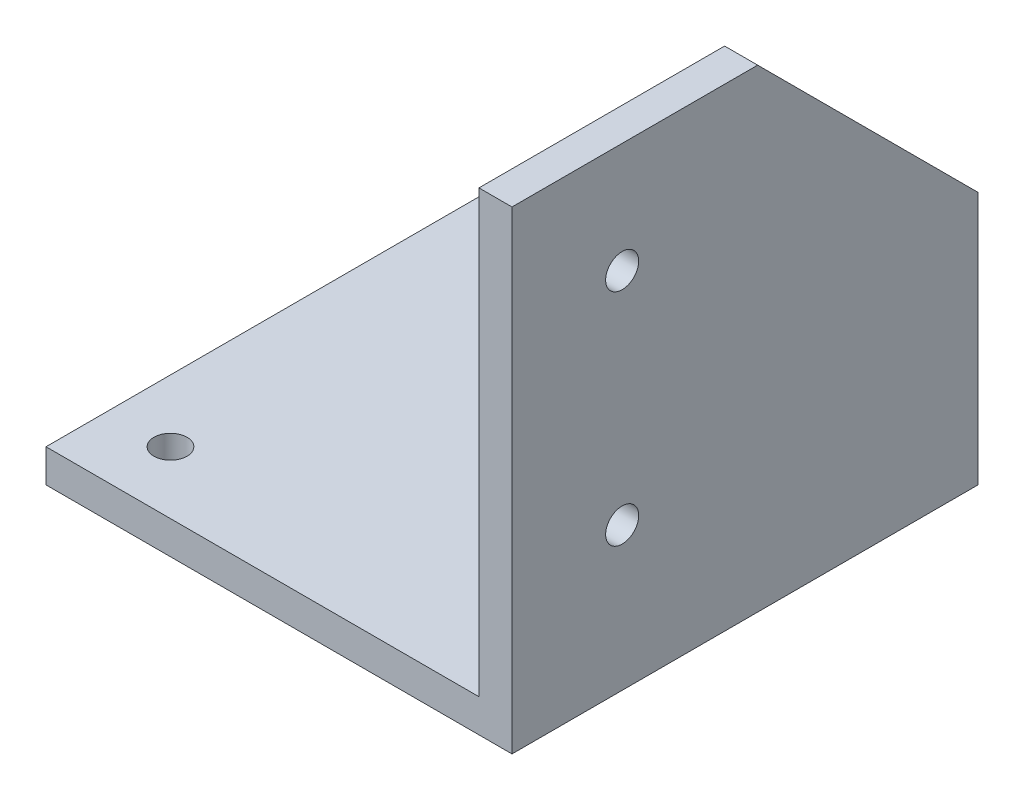
ISO-10303-21;
HEADER;
FILE_DESCRIPTION(('STEP AP214'),'2;1');
FILE_NAME('part.step','',(''),(''),'','','');
FILE_SCHEMA(('AUTOMOTIVE_DESIGN { 1 0 10303 214 1 1 1 1 }'));
ENDSEC;
DATA;
#1=APPLICATION_CONTEXT('core data for automotive mechanical design processes');
#2=APPLICATION_PROTOCOL_DEFINITION('international standard','automotive_design',2000,#1);
#3=PRODUCT_CONTEXT('',#1,'mechanical');
#4=PRODUCT('Part','Part','',(#3));
#5=PRODUCT_RELATED_PRODUCT_CATEGORY('part','',(#4));
#6=PRODUCT_DEFINITION_FORMATION('','',#4);
#7=PRODUCT_DEFINITION_CONTEXT('part definition',#1,'design');
#8=PRODUCT_DEFINITION('design','',#6,#7);
#9=PRODUCT_DEFINITION_SHAPE('','',#8);
#10=(LENGTH_UNIT() NAMED_UNIT(*) SI_UNIT(.MILLI.,.METRE.));
#11=(NAMED_UNIT(*) PLANE_ANGLE_UNIT() SI_UNIT($,.RADIAN.));
#12=(NAMED_UNIT(*) SI_UNIT($,.STERADIAN.) SOLID_ANGLE_UNIT());
#13=UNCERTAINTY_MEASURE_WITH_UNIT(LENGTH_MEASURE(1.E-05),#10,'distance_accuracy_value','');
#14=(GEOMETRIC_REPRESENTATION_CONTEXT(3) GLOBAL_UNCERTAINTY_ASSIGNED_CONTEXT((#13)) GLOBAL_UNIT_ASSIGNED_CONTEXT((#10,
#11,#12)) REPRESENTATION_CONTEXT('',''));
#15=CARTESIAN_POINT('',(0.,0.,0.));
#16=DIRECTION('',(0.,0.,1.));
#17=DIRECTION('',(1.,0.,0.));
#18=AXIS2_PLACEMENT_3D('',#15,#16,#17);
#19=CARTESIAN_POINT('',(0.,3.,0.));
#20=DIRECTION('',(0.,-1.,0.));
#21=DIRECTION('',(0.,0.,-1.));
#22=AXIS2_PLACEMENT_3D('',#19,#20,#21);
#23=PLANE('',#22);
#24=CARTESIAN_POINT('',(5.65,3.,-5.65));
#25=DIRECTION('',(0.,1.,0.));
#26=DIRECTION('',(0.,0.,1.));
#27=AXIS2_PLACEMENT_3D('',#24,#25,#26);
#28=CIRCLE('',#27,1.5);
#29=CARTESIAN_POINT('',(5.65,3.,-4.14999999999999));
#30=VERTEX_POINT('',#29);
#31=EDGE_CURVE('E145',#30,#30,#28,.T.);
#32=ORIENTED_EDGE('',*,*,#31,.F.);
#33=EDGE_LOOP('',(#32));
#34=FACE_BOUND('',#33,.T.);
#35=CARTESIAN_POINT('',(36.65,3.,-5.65));
#36=DIRECTION('',(0.,1.,0.));
#37=DIRECTION('',(0.,0.,1.));
#38=AXIS2_PLACEMENT_3D('',#35,#36,#37);
#39=CIRCLE('',#38,1.5);
#40=CARTESIAN_POINT('',(36.65,3.,-4.15));
#41=VERTEX_POINT('',#40);
#42=EDGE_CURVE('E139',#41,#41,#39,.T.);
#43=ORIENTED_EDGE('',*,*,#42,.F.);
#44=EDGE_LOOP('',(#43));
#45=FACE_BOUND('',#44,.T.);
#46=CARTESIAN_POINT('',(36.65,3.,-36.65));
#47=DIRECTION('',(0.,1.,0.));
#48=DIRECTION('',(0.,0.,1.));
#49=AXIS2_PLACEMENT_3D('',#46,#47,#48);
#50=CIRCLE('',#49,1.5);
#51=CARTESIAN_POINT('',(36.65,3.,-35.15));
#52=VERTEX_POINT('',#51);
#53=EDGE_CURVE('E134',#52,#52,#50,.T.);
#54=ORIENTED_EDGE('',*,*,#53,.F.);
#55=EDGE_LOOP('',(#54));
#56=FACE_BOUND('',#55,.T.);
#57=CARTESIAN_POINT('',(5.64999999999999,3.,-36.65));
#58=DIRECTION('',(0.,1.,0.));
#59=DIRECTION('',(0.,0.,1.));
#60=AXIS2_PLACEMENT_3D('',#57,#58,#59);
#61=CIRCLE('',#60,1.5);
#62=CARTESIAN_POINT('',(5.64999999999999,3.,-35.15));
#63=VERTEX_POINT('',#62);
#64=EDGE_CURVE('E108',#63,#63,#61,.T.);
#65=ORIENTED_EDGE('',*,*,#64,.F.);
#66=EDGE_LOOP('',(#65));
#67=FACE_BOUND('',#66,.T.);
#68=DIRECTION('',(0.,0.,1.));
#69=VECTOR('',#68,1.);
#70=CARTESIAN_POINT('',(39.3,3.,-42.3));
#71=LINE('',#70,#69);
#72=CARTESIAN_POINT('',(39.3,3.,-42.3));
#73=VERTEX_POINT('',#72);
#74=CARTESIAN_POINT('',(39.3,3.,0.));
#75=VERTEX_POINT('',#74);
#76=EDGE_CURVE('E122',#73,#75,#71,.T.);
#77=ORIENTED_EDGE('',*,*,#76,.F.);
#78=DIRECTION('',(-1.,0.,0.));
#79=VECTOR('',#78,1.);
#80=CARTESIAN_POINT('',(0.,3.,-42.3));
#81=LINE('',#80,#79);
#82=CARTESIAN_POINT('',(0.,3.,-42.3));
#83=VERTEX_POINT('',#82);
#84=EDGE_CURVE('E107',#73,#83,#81,.T.);
#85=ORIENTED_EDGE('',*,*,#84,.T.);
#86=DIRECTION('',(0.,0.,1.));
#87=VECTOR('',#86,1.);
#88=CARTESIAN_POINT('',(0.,3.,0.));
#89=LINE('',#88,#87);
#90=CARTESIAN_POINT('',(0.,3.,0.));
#91=VERTEX_POINT('',#90);
#92=EDGE_CURVE('E154',#83,#91,#89,.T.);
#93=ORIENTED_EDGE('',*,*,#92,.T.);
#94=DIRECTION('',(1.,0.,0.));
#95=VECTOR('',#94,1.);
#96=CARTESIAN_POINT('',(0.,3.,0.));
#97=LINE('',#96,#95);
#98=EDGE_CURVE('E157',#91,#75,#97,.T.);
#99=ORIENTED_EDGE('',*,*,#98,.T.);
#100=EDGE_LOOP('',(#77,#85,#93,#99));
#101=FACE_BOUND('',#100,.T.);
#102=ADVANCED_FACE('F33',(#34,#45,#56,#67,#101),#23,.F.);
#103=CARTESIAN_POINT('',(0.,3.,0.));
#104=DIRECTION('',(1.,0.,0.));
#105=DIRECTION('',(0.,0.,-1.));
#106=AXIS2_PLACEMENT_3D('',#103,#104,#105);
#107=PLANE('',#106);
#108=DIRECTION('',(0.,0.,1.));
#109=VECTOR('',#108,1.);
#110=CARTESIAN_POINT('',(0.,0.,0.));
#111=LINE('',#110,#109);
#112=CARTESIAN_POINT('',(0.,0.,-42.3));
#113=VERTEX_POINT('',#112);
#114=CARTESIAN_POINT('',(0.,0.,0.));
#115=VERTEX_POINT('',#114);
#116=EDGE_CURVE('E151',#113,#115,#111,.T.);
#117=ORIENTED_EDGE('',*,*,#116,.T.);
#118=DIRECTION('',(0.,-1.,0.));
#119=VECTOR('',#118,1.);
#120=CARTESIAN_POINT('',(0.,3.,0.));
#121=LINE('',#120,#119);
#122=EDGE_CURVE('E43',#91,#115,#121,.T.);
#123=ORIENTED_EDGE('',*,*,#122,.F.);
#124=ORIENTED_EDGE('',*,*,#92,.F.);
#125=DIRECTION('',(0.,-1.,0.));
#126=VECTOR('',#125,1.);
#127=CARTESIAN_POINT('',(0.,3.,-42.3));
#128=LINE('',#127,#126);
#129=EDGE_CURVE('E170',#83,#113,#128,.T.);
#130=ORIENTED_EDGE('',*,*,#129,.T.);
#131=EDGE_LOOP('',(#117,#123,#124,#130));
#132=FACE_BOUND('',#131,.T.);
#133=ADVANCED_FACE('F35',(#132),#107,.F.);
#134=CARTESIAN_POINT('',(0.,3.,0.));
#135=DIRECTION('',(0.,0.,-1.));
#136=DIRECTION('',(-1.,0.,0.));
#137=AXIS2_PLACEMENT_3D('',#134,#135,#136);
#138=PLANE('',#137);
#139=DIRECTION('',(1.,0.,0.));
#140=VECTOR('',#139,1.);
#141=CARTESIAN_POINT('',(0.,0.,0.));
#142=LINE('',#141,#140);
#143=CARTESIAN_POINT('',(42.3,0.,0.));
#144=VERTEX_POINT('',#143);
#145=EDGE_CURVE('E177',#115,#144,#142,.T.);
#146=ORIENTED_EDGE('',*,*,#145,.T.);
#147=DIRECTION('',(0.,-1.,0.));
#148=VECTOR('',#147,1.);
#149=CARTESIAN_POINT('',(42.3,3.,0.));
#150=LINE('',#149,#148);
#151=CARTESIAN_POINT('',(42.3,43.,0.));
#152=VERTEX_POINT('',#151);
#153=EDGE_CURVE('E165',#152,#144,#150,.T.);
#154=ORIENTED_EDGE('',*,*,#153,.F.);
#155=DIRECTION('',(1.,0.,0.));
#156=VECTOR('',#155,1.);
#157=CARTESIAN_POINT('',(42.3,43.,0.));
#158=LINE('',#157,#156);
#159=CARTESIAN_POINT('',(39.3,43.,0.));
#160=VERTEX_POINT('',#159);
#161=EDGE_CURVE('E114',#160,#152,#158,.T.);
#162=ORIENTED_EDGE('',*,*,#161,.F.);
#163=DIRECTION('',(0.,-1.,0.));
#164=VECTOR('',#163,1.);
#165=CARTESIAN_POINT('',(39.3,43.,0.));
#166=LINE('',#165,#164);
#167=EDGE_CURVE('E109',#160,#75,#166,.T.);
#168=ORIENTED_EDGE('',*,*,#167,.T.);
#169=ORIENTED_EDGE('',*,*,#98,.F.);
#170=ORIENTED_EDGE('',*,*,#122,.T.);
#171=EDGE_LOOP('',(#146,#154,#162,#168,#169,#170));
#172=FACE_BOUND('',#171,.T.);
#173=ADVANCED_FACE('F187',(#172),#138,.F.);
#174=CARTESIAN_POINT('',(42.3,3.,0.));
#175=DIRECTION('',(-1.,0.,0.));
#176=DIRECTION('',(0.,0.,1.));
#177=AXIS2_PLACEMENT_3D('',#174,#175,#176);
#178=PLANE('',#177);
#179=CARTESIAN_POINT('',(42.3,13.,-10.));
#180=DIRECTION('',(-1.,0.,0.));
#181=DIRECTION('',(0.,0.,1.));
#182=AXIS2_PLACEMENT_3D('',#179,#180,#181);
#183=CIRCLE('',#182,1.5);
#184=CARTESIAN_POINT('',(42.3,13.,-8.5));
#185=VERTEX_POINT('',#184);
#186=EDGE_CURVE('E201',#185,#185,#183,.T.);
#187=ORIENTED_EDGE('',*,*,#186,.T.);
#188=EDGE_LOOP('',(#187));
#189=FACE_BOUND('',#188,.T.);
#190=CARTESIAN_POINT('',(42.3,33.,-10.));
#191=DIRECTION('',(-1.,0.,0.));
#192=DIRECTION('',(0.,0.,1.));
#193=AXIS2_PLACEMENT_3D('',#190,#191,#192);
#194=CIRCLE('',#193,1.5);
#195=CARTESIAN_POINT('',(42.3,33.,-8.5));
#196=VERTEX_POINT('',#195);
#197=EDGE_CURVE('E102',#196,#196,#194,.T.);
#198=ORIENTED_EDGE('',*,*,#197,.T.);
#199=EDGE_LOOP('',(#198));
#200=FACE_BOUND('',#199,.T.);
#201=DIRECTION('',(0.,-1.,0.));
#202=VECTOR('',#201,1.);
#203=CARTESIAN_POINT('',(42.3,3.,-42.3));
#204=LINE('',#203,#202);
#205=CARTESIAN_POINT('',(42.3,23.,-42.3));
#206=VERTEX_POINT('',#205);
#207=CARTESIAN_POINT('',(42.3,0.,-42.3));
#208=VERTEX_POINT('',#207);
#209=EDGE_CURVE('E168',#206,#208,#204,.T.);
#210=ORIENTED_EDGE('',*,*,#209,.F.);
#211=DIRECTION('',(0.,0.707106781186548,0.707106781186547));
#212=VECTOR('',#211,1.);
#213=CARTESIAN_POINT('',(42.3,34.15,-31.15));
#214=LINE('',#213,#212);
#215=CARTESIAN_POINT('',(42.3,43.,-22.3));
#216=VERTEX_POINT('',#215);
#217=EDGE_CURVE('E94',#206,#216,#214,.T.);
#218=ORIENTED_EDGE('',*,*,#217,.T.);
#219=DIRECTION('',(0.,0.,-1.));
#220=VECTOR('',#219,1.);
#221=CARTESIAN_POINT('',(42.3,43.,-42.3));
#222=LINE('',#221,#220);
#223=EDGE_CURVE('E127',#152,#216,#222,.T.);
#224=ORIENTED_EDGE('',*,*,#223,.F.);
#225=ORIENTED_EDGE('',*,*,#153,.T.);
#226=DIRECTION('',(0.,0.,-1.));
#227=VECTOR('',#226,1.);
#228=CARTESIAN_POINT('',(42.3,0.,0.));
#229=LINE('',#228,#227);
#230=EDGE_CURVE('E174',#144,#208,#229,.T.);
#231=ORIENTED_EDGE('',*,*,#230,.T.);
#232=EDGE_LOOP('',(#210,#218,#224,#225,#231));
#233=FACE_BOUND('',#232,.T.);
#234=ADVANCED_FACE('F190',(#189,#200,#233),#178,.F.);
#235=CARTESIAN_POINT('',(0.,3.,-42.3));
#236=DIRECTION('',(0.,0.,1.));
#237=DIRECTION('',(1.,0.,0.));
#238=AXIS2_PLACEMENT_3D('',#235,#236,#237);
#239=PLANE('',#238);
#240=DIRECTION('',(0.,-1.,0.));
#241=VECTOR('',#240,1.);
#242=CARTESIAN_POINT('',(39.3,43.,-42.3));
#243=LINE('',#242,#241);
#244=CARTESIAN_POINT('',(39.3,23.,-42.3));
#245=VERTEX_POINT('',#244);
#246=EDGE_CURVE('E37',#245,#73,#243,.T.);
#247=ORIENTED_EDGE('',*,*,#246,.F.);
#248=DIRECTION('',(-1.,0.,0.));
#249=VECTOR('',#248,1.);
#250=CARTESIAN_POINT('',(79.3,23.,-42.3));
#251=LINE('',#250,#249);
#252=EDGE_CURVE('E91',#206,#245,#251,.T.);
#253=ORIENTED_EDGE('',*,*,#252,.F.);
#254=ORIENTED_EDGE('',*,*,#209,.T.);
#255=DIRECTION('',(-1.,0.,0.));
#256=VECTOR('',#255,1.);
#257=CARTESIAN_POINT('',(0.,0.,-42.3));
#258=LINE('',#257,#256);
#259=EDGE_CURVE('E158',#208,#113,#258,.T.);
#260=ORIENTED_EDGE('',*,*,#259,.T.);
#261=ORIENTED_EDGE('',*,*,#129,.F.);
#262=ORIENTED_EDGE('',*,*,#84,.F.);
#263=EDGE_LOOP('',(#247,#253,#254,#260,#261,#262));
#264=FACE_BOUND('',#263,.T.);
#265=ADVANCED_FACE('F105',(#264),#239,.F.);
#266=CARTESIAN_POINT('',(0.,0.,0.));
#267=DIRECTION('',(0.,-1.,0.));
#268=DIRECTION('',(0.,0.,-1.));
#269=AXIS2_PLACEMENT_3D('',#266,#267,#268);
#270=PLANE('',#269);
#271=CARTESIAN_POINT('',(5.64999999999999,0.,-36.65));
#272=DIRECTION('',(0.,1.,0.));
#273=DIRECTION('',(0.,0.,1.));
#274=AXIS2_PLACEMENT_3D('',#271,#272,#273);
#275=CIRCLE('',#274,1.5);
#276=CARTESIAN_POINT('',(5.64999999999999,0.,-35.15));
#277=VERTEX_POINT('',#276);
#278=EDGE_CURVE('E111',#277,#277,#275,.T.);
#279=ORIENTED_EDGE('',*,*,#278,.T.);
#280=EDGE_LOOP('',(#279));
#281=FACE_BOUND('',#280,.T.);
#282=CARTESIAN_POINT('',(36.65,0.,-36.65));
#283=DIRECTION('',(0.,1.,0.));
#284=DIRECTION('',(0.,0.,1.));
#285=AXIS2_PLACEMENT_3D('',#282,#283,#284);
#286=CIRCLE('',#285,1.5);
#287=CARTESIAN_POINT('',(36.65,0.,-35.15));
#288=VERTEX_POINT('',#287);
#289=EDGE_CURVE('E136',#288,#288,#286,.T.);
#290=ORIENTED_EDGE('',*,*,#289,.T.);
#291=EDGE_LOOP('',(#290));
#292=FACE_BOUND('',#291,.T.);
#293=CARTESIAN_POINT('',(36.65,0.,-5.65));
#294=DIRECTION('',(0.,1.,0.));
#295=DIRECTION('',(0.,0.,1.));
#296=AXIS2_PLACEMENT_3D('',#293,#294,#295);
#297=CIRCLE('',#296,1.5);
#298=CARTESIAN_POINT('',(36.65,0.,-4.15));
#299=VERTEX_POINT('',#298);
#300=EDGE_CURVE('E142',#299,#299,#297,.T.);
#301=ORIENTED_EDGE('',*,*,#300,.T.);
#302=EDGE_LOOP('',(#301));
#303=FACE_BOUND('',#302,.T.);
#304=CARTESIAN_POINT('',(5.65,0.,-5.65));
#305=DIRECTION('',(0.,1.,0.));
#306=DIRECTION('',(0.,0.,1.));
#307=AXIS2_PLACEMENT_3D('',#304,#305,#306);
#308=CIRCLE('',#307,1.5);
#309=CARTESIAN_POINT('',(5.65,0.,-4.14999999999999));
#310=VERTEX_POINT('',#309);
#311=EDGE_CURVE('E148',#310,#310,#308,.T.);
#312=ORIENTED_EDGE('',*,*,#311,.T.);
#313=EDGE_LOOP('',(#312));
#314=FACE_BOUND('',#313,.T.);
#315=ORIENTED_EDGE('',*,*,#116,.F.);
#316=ORIENTED_EDGE('',*,*,#259,.F.);
#317=ORIENTED_EDGE('',*,*,#230,.F.);
#318=ORIENTED_EDGE('',*,*,#145,.F.);
#319=EDGE_LOOP('',(#315,#316,#317,#318));
#320=FACE_BOUND('',#319,.T.);
#321=ADVANCED_FACE('F185',(#281,#292,#303,#314,#320),#270,.T.);
#322=CARTESIAN_POINT('',(5.65,0.,-5.65));
#323=DIRECTION('',(0.,1.,0.));
#324=DIRECTION('',(0.,0.,1.));
#325=AXIS2_PLACEMENT_3D('',#322,#323,#324);
#326=CYLINDRICAL_SURFACE('',#325,1.5);
#327=ORIENTED_EDGE('',*,*,#311,.F.);
#328=EDGE_LOOP('',(#327));
#329=FACE_BOUND('',#328,.T.);
#330=ORIENTED_EDGE('',*,*,#31,.T.);
#331=EDGE_LOOP('',(#330));
#332=FACE_BOUND('',#331,.T.);
#333=ADVANCED_FACE('F243',(#329,#332),#326,.F.);
#334=CARTESIAN_POINT('',(36.65,0.,-5.65));
#335=DIRECTION('',(0.,1.,0.));
#336=DIRECTION('',(0.,0.,1.));
#337=AXIS2_PLACEMENT_3D('',#334,#335,#336);
#338=CYLINDRICAL_SURFACE('',#337,1.5);
#339=ORIENTED_EDGE('',*,*,#300,.F.);
#340=EDGE_LOOP('',(#339));
#341=FACE_BOUND('',#340,.T.);
#342=ORIENTED_EDGE('',*,*,#42,.T.);
#343=EDGE_LOOP('',(#342));
#344=FACE_BOUND('',#343,.T.);
#345=ADVANCED_FACE('F277',(#341,#344),#338,.F.);
#346=CARTESIAN_POINT('',(36.65,0.,-36.65));
#347=DIRECTION('',(0.,1.,0.));
#348=DIRECTION('',(0.,0.,1.));
#349=AXIS2_PLACEMENT_3D('',#346,#347,#348);
#350=CYLINDRICAL_SURFACE('',#349,1.5);
#351=ORIENTED_EDGE('',*,*,#289,.F.);
#352=EDGE_LOOP('',(#351));
#353=FACE_BOUND('',#352,.T.);
#354=ORIENTED_EDGE('',*,*,#53,.T.);
#355=EDGE_LOOP('',(#354));
#356=FACE_BOUND('',#355,.T.);
#357=ADVANCED_FACE('F284',(#353,#356),#350,.F.);
#358=CARTESIAN_POINT('',(5.64999999999999,0.,-36.65));
#359=DIRECTION('',(0.,1.,0.));
#360=DIRECTION('',(0.,0.,1.));
#361=AXIS2_PLACEMENT_3D('',#358,#359,#360);
#362=CYLINDRICAL_SURFACE('',#361,1.5);
#363=ORIENTED_EDGE('',*,*,#278,.F.);
#364=EDGE_LOOP('',(#363));
#365=FACE_BOUND('',#364,.T.);
#366=ORIENTED_EDGE('',*,*,#64,.T.);
#367=EDGE_LOOP('',(#366));
#368=FACE_BOUND('',#367,.T.);
#369=ADVANCED_FACE('F221',(#365,#368),#362,.F.);
#370=CARTESIAN_POINT('',(39.3,43.,-42.3));
#371=DIRECTION('',(1.,0.,0.));
#372=DIRECTION('',(0.,0.,-1.));
#373=AXIS2_PLACEMENT_3D('',#370,#371,#372);
#374=PLANE('',#373);
#375=CARTESIAN_POINT('',(39.3,13.,-10.));
#376=DIRECTION('',(-1.,0.,0.));
#377=DIRECTION('',(0.,0.,1.));
#378=AXIS2_PLACEMENT_3D('',#375,#376,#377);
#379=CIRCLE('',#378,1.5);
#380=CARTESIAN_POINT('',(39.3,13.,-8.5));
#381=VERTEX_POINT('',#380);
#382=EDGE_CURVE('E204',#381,#381,#379,.T.);
#383=ORIENTED_EDGE('',*,*,#382,.F.);
#384=EDGE_LOOP('',(#383));
#385=FACE_BOUND('',#384,.T.);
#386=CARTESIAN_POINT('',(39.3,33.,-10.));
#387=DIRECTION('',(-1.,0.,0.));
#388=DIRECTION('',(0.,0.,1.));
#389=AXIS2_PLACEMENT_3D('',#386,#387,#388);
#390=CIRCLE('',#389,1.5);
#391=CARTESIAN_POINT('',(39.3,33.,-8.5));
#392=VERTEX_POINT('',#391);
#393=EDGE_CURVE('E198',#392,#392,#390,.T.);
#394=ORIENTED_EDGE('',*,*,#393,.F.);
#395=EDGE_LOOP('',(#394));
#396=FACE_BOUND('',#395,.T.);
#397=DIRECTION('',(0.,0.,1.));
#398=VECTOR('',#397,1.);
#399=CARTESIAN_POINT('',(39.3,43.,-42.3));
#400=LINE('',#399,#398);
#401=CARTESIAN_POINT('',(39.3,43.,-22.3));
#402=VERTEX_POINT('',#401);
#403=EDGE_CURVE('E101',#402,#160,#400,.T.);
#404=ORIENTED_EDGE('',*,*,#403,.F.);
#405=DIRECTION('',(0.,0.707106781186548,0.707106781186547));
#406=VECTOR('',#405,1.);
#407=CARTESIAN_POINT('',(39.3,23.,-42.3));
#408=LINE('',#407,#406);
#409=EDGE_CURVE('E50',#245,#402,#408,.T.);
#410=ORIENTED_EDGE('',*,*,#409,.F.);
#411=ORIENTED_EDGE('',*,*,#246,.T.);
#412=ORIENTED_EDGE('',*,*,#76,.T.);
#413=ORIENTED_EDGE('',*,*,#167,.F.);
#414=EDGE_LOOP('',(#404,#410,#411,#412,#413));
#415=FACE_BOUND('',#414,.T.);
#416=ADVANCED_FACE('F99',(#385,#396,#415),#374,.F.);
#417=CARTESIAN_POINT('',(0.,43.,0.));
#418=DIRECTION('',(0.,-1.,0.));
#419=DIRECTION('',(0.,0.,-1.));
#420=AXIS2_PLACEMENT_3D('',#417,#418,#419);
#421=PLANE('',#420);
#422=ORIENTED_EDGE('',*,*,#223,.T.);
#423=DIRECTION('',(-1.,0.,0.));
#424=VECTOR('',#423,1.);
#425=CARTESIAN_POINT('',(0.,43.,-22.3));
#426=LINE('',#425,#424);
#427=EDGE_CURVE('E11',#216,#402,#426,.T.);
#428=ORIENTED_EDGE('',*,*,#427,.T.);
#429=ORIENTED_EDGE('',*,*,#403,.T.);
#430=ORIENTED_EDGE('',*,*,#161,.T.);
#431=EDGE_LOOP('',(#422,#428,#429,#430));
#432=FACE_BOUND('',#431,.T.);
#433=ADVANCED_FACE('F194',(#432),#421,.F.);
#434=CARTESIAN_POINT('',(79.3,23.,-42.3));
#435=DIRECTION('',(0.,-0.707106781186547,0.707106781186548));
#436=DIRECTION('',(0.,-0.707106781186548,-0.707106781186547));
#437=AXIS2_PLACEMENT_3D('',#434,#435,#436);
#438=PLANE('',#437);
#439=ORIENTED_EDGE('',*,*,#252,.T.);
#440=ORIENTED_EDGE('',*,*,#409,.T.);
#441=ORIENTED_EDGE('',*,*,#427,.F.);
#442=ORIENTED_EDGE('',*,*,#217,.F.);
#443=EDGE_LOOP('',(#439,#440,#441,#442));
#444=FACE_BOUND('',#443,.T.);
#445=ADVANCED_FACE('F92',(#444),#438,.F.);
#446=CARTESIAN_POINT('',(42.3,33.,-10.));
#447=DIRECTION('',(-1.,0.,0.));
#448=DIRECTION('',(0.,0.,1.));
#449=AXIS2_PLACEMENT_3D('',#446,#447,#448);
#450=CYLINDRICAL_SURFACE('',#449,1.5);
#451=ORIENTED_EDGE('',*,*,#197,.F.);
#452=EDGE_LOOP('',(#451));
#453=FACE_BOUND('',#452,.T.);
#454=ORIENTED_EDGE('',*,*,#393,.T.);
#455=EDGE_LOOP('',(#454));
#456=FACE_BOUND('',#455,.T.);
#457=ADVANCED_FACE('F215',(#453,#456),#450,.F.);
#458=CARTESIAN_POINT('',(42.3,13.,-10.));
#459=DIRECTION('',(-1.,0.,0.));
#460=DIRECTION('',(0.,0.,1.));
#461=AXIS2_PLACEMENT_3D('',#458,#459,#460);
#462=CYLINDRICAL_SURFACE('',#461,1.5);
#463=ORIENTED_EDGE('',*,*,#186,.F.);
#464=EDGE_LOOP('',(#463));
#465=FACE_BOUND('',#464,.T.);
#466=ORIENTED_EDGE('',*,*,#382,.T.);
#467=EDGE_LOOP('',(#466));
#468=FACE_BOUND('',#467,.T.);
#469=ADVANCED_FACE('F212',(#465,#468),#462,.F.);
#470=CLOSED_SHELL('',(#102,#133,#173,#234,#265,#321,#333,#345,#357,#369,#416,#433,#445,#457,#469));
#471=MANIFOLD_SOLID_BREP('B2',#470);
#472=ADVANCED_BREP_SHAPE_REPRESENTATION('',(#18,#471),#14);
#473=SHAPE_DEFINITION_REPRESENTATION(#9,#472);
ENDSEC;
END-ISO-10303-21;
